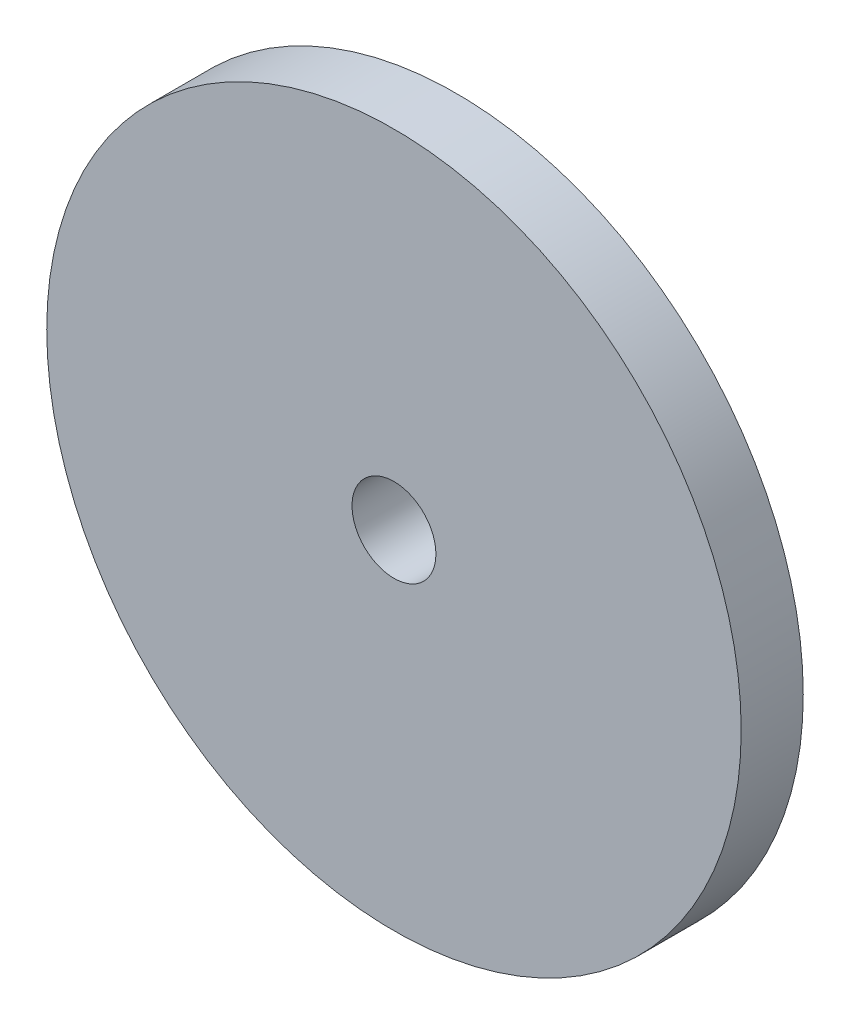
ISO-10303-21;
HEADER;
FILE_DESCRIPTION(('STEP AP214'),'2;1');
FILE_NAME('part.step','',(''),(''),'','','');
FILE_SCHEMA(('AUTOMOTIVE_DESIGN { 1 0 10303 214 1 1 1 1 }'));
ENDSEC;
DATA;
#1=APPLICATION_CONTEXT('core data for automotive mechanical design processes');
#2=APPLICATION_PROTOCOL_DEFINITION('international standard','automotive_design',2000,#1);
#3=PRODUCT_CONTEXT('',#1,'mechanical');
#4=PRODUCT('Part','Part','',(#3));
#5=PRODUCT_RELATED_PRODUCT_CATEGORY('part','',(#4));
#6=PRODUCT_DEFINITION_FORMATION('','',#4);
#7=PRODUCT_DEFINITION_CONTEXT('part definition',#1,'design');
#8=PRODUCT_DEFINITION('design','',#6,#7);
#9=PRODUCT_DEFINITION_SHAPE('','',#8);
#10=(LENGTH_UNIT() NAMED_UNIT(*) SI_UNIT(.MILLI.,.METRE.));
#11=(NAMED_UNIT(*) PLANE_ANGLE_UNIT() SI_UNIT($,.RADIAN.));
#12=(NAMED_UNIT(*) SI_UNIT($,.STERADIAN.) SOLID_ANGLE_UNIT());
#13=UNCERTAINTY_MEASURE_WITH_UNIT(LENGTH_MEASURE(1.E-05),#10,'distance_accuracy_value','');
#14=(GEOMETRIC_REPRESENTATION_CONTEXT(3) GLOBAL_UNCERTAINTY_ASSIGNED_CONTEXT((#13)) GLOBAL_UNIT_ASSIGNED_CONTEXT((#10,
#11,#12)) REPRESENTATION_CONTEXT('',''));
#15=CARTESIAN_POINT('',(0.,0.,0.));
#16=DIRECTION('',(0.,0.,1.));
#17=DIRECTION('',(1.,0.,0.));
#18=AXIS2_PLACEMENT_3D('',#15,#16,#17);
#19=CARTESIAN_POINT('',(36.636,18.676,3.));
#20=DIRECTION('',(0.,0.,1.));
#21=DIRECTION('',(1.,0.,0.));
#22=AXIS2_PLACEMENT_3D('',#19,#20,#21);
#23=PLANE('',#22);
#24=CARTESIAN_POINT('',(36.636,18.676,3.));
#25=DIRECTION('',(0.,0.,1.));
#26=DIRECTION('',(1.,0.,0.));
#27=AXIS2_PLACEMENT_3D('',#24,#25,#26);
#28=CIRCLE('',#27,16.7836582535523);
#29=CARTESIAN_POINT('',(53.4196582535523,18.676,3.));
#30=VERTEX_POINT('',#29);
#31=EDGE_CURVE('E10',#30,#30,#28,.T.);
#32=ORIENTED_EDGE('',*,*,#31,.T.);
#33=EDGE_LOOP('',(#32));
#34=FACE_BOUND('',#33,.T.);
#35=CARTESIAN_POINT('',(36.636,18.676,3.));
#36=DIRECTION('',(0.,0.,1.));
#37=DIRECTION('',(1.,0.,0.));
#38=AXIS2_PLACEMENT_3D('',#35,#36,#37);
#39=CIRCLE('',#38,2.02770926190349);
#40=CARTESIAN_POINT('',(38.6637092619035,18.676,3.));
#41=VERTEX_POINT('',#40);
#42=EDGE_CURVE('E42',#41,#41,#39,.T.);
#43=ORIENTED_EDGE('',*,*,#42,.F.);
#44=EDGE_LOOP('',(#43));
#45=FACE_BOUND('',#44,.T.);
#46=ADVANCED_FACE('F31',(#34,#45),#23,.T.);
#47=CARTESIAN_POINT('',(36.636,18.676,0.));
#48=DIRECTION('',(0.,0.,1.));
#49=DIRECTION('',(1.,0.,0.));
#50=AXIS2_PLACEMENT_3D('',#47,#48,#49);
#51=PLANE('',#50);
#52=CARTESIAN_POINT('',(36.636,18.676,0.));
#53=DIRECTION('',(0.,0.,1.));
#54=DIRECTION('',(1.,0.,0.));
#55=AXIS2_PLACEMENT_3D('',#52,#53,#54);
#56=CIRCLE('',#55,16.7836582535523);
#57=CARTESIAN_POINT('',(53.4196582535523,18.676,0.));
#58=VERTEX_POINT('',#57);
#59=EDGE_CURVE('E35',#58,#58,#56,.T.);
#60=ORIENTED_EDGE('',*,*,#59,.F.);
#61=EDGE_LOOP('',(#60));
#62=FACE_BOUND('',#61,.T.);
#63=CARTESIAN_POINT('',(36.636,18.676,0.));
#64=DIRECTION('',(0.,0.,1.));
#65=DIRECTION('',(1.,0.,0.));
#66=AXIS2_PLACEMENT_3D('',#63,#64,#65);
#67=CIRCLE('',#66,2.02770926190349);
#68=CARTESIAN_POINT('',(38.6637092619035,18.676,0.));
#69=VERTEX_POINT('',#68);
#70=EDGE_CURVE('E44',#69,#69,#67,.T.);
#71=ORIENTED_EDGE('',*,*,#70,.T.);
#72=EDGE_LOOP('',(#71));
#73=FACE_BOUND('',#72,.T.);
#74=ADVANCED_FACE('F54',(#62,#73),#51,.F.);
#75=CARTESIAN_POINT('',(36.636,18.676,3.));
#76=DIRECTION('',(0.,0.,-1.));
#77=DIRECTION('',(-1.,0.,0.));
#78=AXIS2_PLACEMENT_3D('',#75,#76,#77);
#79=CYLINDRICAL_SURFACE('',#78,16.7836582535523);
#80=ORIENTED_EDGE('',*,*,#31,.F.);
#81=EDGE_LOOP('',(#80));
#82=FACE_BOUND('',#81,.T.);
#83=ORIENTED_EDGE('',*,*,#59,.T.);
#84=EDGE_LOOP('',(#83));
#85=FACE_BOUND('',#84,.T.);
#86=ADVANCED_FACE('F33',(#82,#85),#79,.T.);
#87=CARTESIAN_POINT('',(36.636,18.676,3.));
#88=DIRECTION('',(0.,0.,-1.));
#89=DIRECTION('',(-1.,0.,0.));
#90=AXIS2_PLACEMENT_3D('',#87,#88,#89);
#91=CYLINDRICAL_SURFACE('',#90,2.02770926190349);
#92=ORIENTED_EDGE('',*,*,#42,.T.);
#93=EDGE_LOOP('',(#92));
#94=FACE_BOUND('',#93,.T.);
#95=ORIENTED_EDGE('',*,*,#70,.F.);
#96=EDGE_LOOP('',(#95));
#97=FACE_BOUND('',#96,.T.);
#98=ADVANCED_FACE('F50',(#94,#97),#91,.F.);
#99=CLOSED_SHELL('',(#46,#74,#86,#98));
#100=MANIFOLD_SOLID_BREP('B2',#99);
#101=ADVANCED_BREP_SHAPE_REPRESENTATION('',(#18,#100),#14);
#102=SHAPE_DEFINITION_REPRESENTATION(#9,#101);
ENDSEC;
END-ISO-10303-21;
